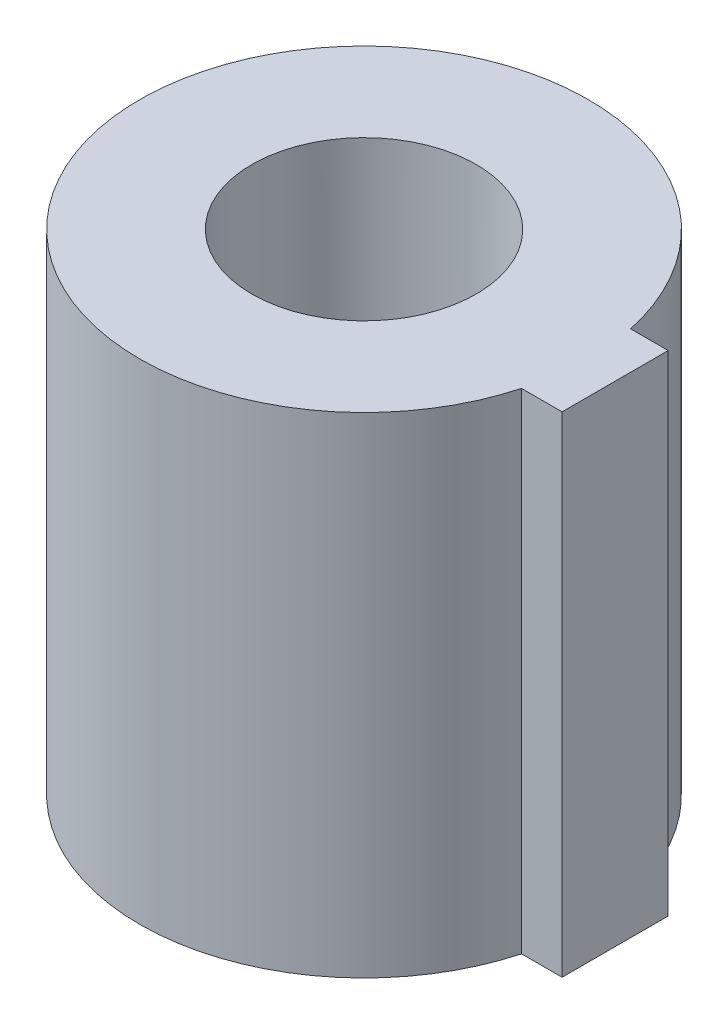
ISO-10303-21;
HEADER;
FILE_DESCRIPTION(('STEP AP214'),'2;1');
FILE_NAME('part.step','',(''),(''),'','','');
FILE_SCHEMA(('AUTOMOTIVE_DESIGN { 1 0 10303 214 1 1 1 1 }'));
ENDSEC;
DATA;
#1=APPLICATION_CONTEXT('core data for automotive mechanical design processes');
#2=APPLICATION_PROTOCOL_DEFINITION('international standard','automotive_design',2000,#1);
#3=PRODUCT_CONTEXT('',#1,'mechanical');
#4=PRODUCT('Part','Part','',(#3));
#5=PRODUCT_RELATED_PRODUCT_CATEGORY('part','',(#4));
#6=PRODUCT_DEFINITION_FORMATION('','',#4);
#7=PRODUCT_DEFINITION_CONTEXT('part definition',#1,'design');
#8=PRODUCT_DEFINITION('design','',#6,#7);
#9=PRODUCT_DEFINITION_SHAPE('','',#8);
#10=(LENGTH_UNIT() NAMED_UNIT(*) SI_UNIT(.MILLI.,.METRE.));
#11=(NAMED_UNIT(*) PLANE_ANGLE_UNIT() SI_UNIT($,.RADIAN.));
#12=(NAMED_UNIT(*) SI_UNIT($,.STERADIAN.) SOLID_ANGLE_UNIT());
#13=UNCERTAINTY_MEASURE_WITH_UNIT(LENGTH_MEASURE(1.E-05),#10,'distance_accuracy_value','');
#14=(GEOMETRIC_REPRESENTATION_CONTEXT(3) GLOBAL_UNCERTAINTY_ASSIGNED_CONTEXT((#13)) GLOBAL_UNIT_ASSIGNED_CONTEXT((#10,
#11,#12)) REPRESENTATION_CONTEXT('',''));
#15=CARTESIAN_POINT('',(0.,0.,0.));
#16=DIRECTION('',(0.,0.,1.));
#17=DIRECTION('',(1.,0.,0.));
#18=AXIS2_PLACEMENT_3D('',#15,#16,#17);
#19=CARTESIAN_POINT('',(0.,12.,0.));
#20=DIRECTION('',(0.,-1.,0.));
#21=DIRECTION('',(0.,0.,-1.));
#22=AXIS2_PLACEMENT_3D('',#19,#20,#21);
#23=CYLINDRICAL_SURFACE('',#22,5.5);
#24=CARTESIAN_POINT('',(0.,12.,0.));
#25=DIRECTION('',(0.,1.,0.));
#26=DIRECTION('',(0.,0.,1.));
#27=AXIS2_PLACEMENT_3D('',#24,#25,#26);
#28=CIRCLE('',#27,5.5);
#29=CARTESIAN_POINT('',(5.37784485907449,12.,-1.15272922741037));
#30=VERTEX_POINT('',#29);
#31=CARTESIAN_POINT('',(5.30616691320654,12.,1.44727077258963));
#32=VERTEX_POINT('',#31);
#33=EDGE_CURVE('E11',#30,#32,#28,.T.);
#34=ORIENTED_EDGE('',*,*,#33,.F.);
#35=DIRECTION('',(0.,-1.,0.));
#36=VECTOR('',#35,1.);
#37=CARTESIAN_POINT('',(5.37784485907449,12.,-1.15272922741037));
#38=LINE('',#37,#36);
#39=CARTESIAN_POINT('',(5.37784485907449,0.,-1.15272922741037));
#40=VERTEX_POINT('',#39);
#41=EDGE_CURVE('E188',#30,#40,#38,.T.);
#42=ORIENTED_EDGE('',*,*,#41,.T.);
#43=CARTESIAN_POINT('',(0.,0.,0.));
#44=DIRECTION('',(0.,1.,0.));
#45=DIRECTION('',(0.,0.,1.));
#46=AXIS2_PLACEMENT_3D('',#43,#44,#45);
#47=CIRCLE('',#46,5.5);
#48=CARTESIAN_POINT('',(5.30616691320654,0.,1.44727077258963));
#49=VERTEX_POINT('',#48);
#50=EDGE_CURVE('E41',#40,#49,#47,.T.);
#51=ORIENTED_EDGE('',*,*,#50,.T.);
#52=DIRECTION('',(0.,-1.,0.));
#53=VECTOR('',#52,1.);
#54=CARTESIAN_POINT('',(5.30616691320654,12.,1.44727077258963));
#55=LINE('',#54,#53);
#56=EDGE_CURVE('E183',#49,#32,#55,.F.);
#57=ORIENTED_EDGE('',*,*,#56,.T.);
#58=EDGE_LOOP('',(#34,#42,#51,#57));
#59=FACE_BOUND('',#58,.T.);
#60=ADVANCED_FACE('F33',(#59),#23,.T.);
#61=CARTESIAN_POINT('',(0.,12.,0.));
#62=DIRECTION('',(0.,1.,0.));
#63=DIRECTION('',(0.,0.,1.));
#64=AXIS2_PLACEMENT_3D('',#61,#62,#63);
#65=PLANE('',#64);
#66=CARTESIAN_POINT('',(0.,12.,0.));
#67=DIRECTION('',(0.,1.,0.));
#68=DIRECTION('',(0.,0.,1.));
#69=AXIS2_PLACEMENT_3D('',#66,#67,#68);
#70=CIRCLE('',#69,2.75);
#71=CARTESIAN_POINT('',(0.,12.,2.75));
#72=VERTEX_POINT('',#71);
#73=EDGE_CURVE('E139',#72,#72,#70,.T.);
#74=ORIENTED_EDGE('',*,*,#73,.F.);
#75=EDGE_LOOP('',(#74));
#76=FACE_BOUND('',#75,.T.);
#77=ORIENTED_EDGE('',*,*,#33,.T.);
#78=DIRECTION('',(1.,0.,0.));
#79=VECTOR('',#78,1.);
#80=CARTESIAN_POINT('',(6.3,12.,1.44727077258963));
#81=LINE('',#80,#79);
#82=CARTESIAN_POINT('',(6.3,12.,1.44727077258963));
#83=VERTEX_POINT('',#82);
#84=EDGE_CURVE('E161',#32,#83,#81,.T.);
#85=ORIENTED_EDGE('',*,*,#84,.T.);
#86=DIRECTION('',(0.,0.,-1.));
#87=VECTOR('',#86,1.);
#88=CARTESIAN_POINT('',(6.3,12.,-1.15272922741037));
#89=LINE('',#88,#87);
#90=CARTESIAN_POINT('',(6.3,12.,-1.15272922741037));
#91=VERTEX_POINT('',#90);
#92=EDGE_CURVE('E178',#83,#91,#89,.T.);
#93=ORIENTED_EDGE('',*,*,#92,.T.);
#94=DIRECTION('',(-1.,0.,0.));
#95=VECTOR('',#94,1.);
#96=CARTESIAN_POINT('',(6.3,12.,-1.15272922741037));
#97=LINE('',#96,#95);
#98=EDGE_CURVE('E56',#91,#30,#97,.T.);
#99=ORIENTED_EDGE('',*,*,#98,.T.);
#100=EDGE_LOOP('',(#77,#85,#93,#99));
#101=FACE_BOUND('',#100,.T.);
#102=ADVANCED_FACE('F205',(#76,#101),#65,.T.);
#103=CARTESIAN_POINT('',(0.,0.,0.));
#104=DIRECTION('',(0.,1.,0.));
#105=DIRECTION('',(0.,0.,1.));
#106=AXIS2_PLACEMENT_3D('',#103,#104,#105);
#107=PLANE('',#106);
#108=DIRECTION('',(0.575898821172485,0.,0.817520976961535));
#109=VECTOR('',#108,1.);
#110=CARTESIAN_POINT('',(1.89159998637329,0.,-4.08678963142863));
#111=LINE('',#110,#109);
#112=CARTESIAN_POINT('',(1.89159998637329,0.,-4.08678963142863));
#113=VERTEX_POINT('',#112);
#114=CARTESIAN_POINT('',(4.48506363392668,0.,-0.405221173716749));
#115=VERTEX_POINT('',#114);
#116=EDGE_CURVE('E149',#113,#115,#111,.T.);
#117=ORIENTED_EDGE('',*,*,#116,.F.);
#118=DIRECTION('',(0.995943344761604,0.,-0.0899825206641158));
#119=VECTOR('',#118,1.);
#120=CARTESIAN_POINT('',(-2.59346364755339,0.,-3.68156845771188));
#121=LINE('',#120,#119);
#122=CARTESIAN_POINT('',(-2.59346364755339,0.,-3.68156845771188));
#123=VERTEX_POINT('',#122);
#124=EDGE_CURVE('E49',#123,#113,#121,.T.);
#125=ORIENTED_EDGE('',*,*,#124,.F.);
#126=DIRECTION('',(0.42004452358912,0.,-0.907503497625651));
#127=VECTOR('',#126,1.);
#128=CARTESIAN_POINT('',(-4.48506363392668,0.,0.405221173716749));
#129=LINE('',#128,#127);
#130=CARTESIAN_POINT('',(-4.48506363392668,0.,0.405221173716749));
#131=VERTEX_POINT('',#130);
#132=EDGE_CURVE('E133',#131,#123,#129,.T.);
#133=ORIENTED_EDGE('',*,*,#132,.F.);
#134=DIRECTION('',(-0.575898821172485,0.,-0.817520976961535));
#135=VECTOR('',#134,1.);
#136=CARTESIAN_POINT('',(-1.89159998637329,0.,4.08678963142863));
#137=LINE('',#136,#135);
#138=CARTESIAN_POINT('',(-1.89159998637329,0.,4.08678963142863));
#139=VERTEX_POINT('',#138);
#140=EDGE_CURVE('E136',#139,#131,#137,.T.);
#141=ORIENTED_EDGE('',*,*,#140,.F.);
#142=DIRECTION('',(-0.995943344761604,0.,0.0899825206641161));
#143=VECTOR('',#142,1.);
#144=CARTESIAN_POINT('',(2.59346364755339,0.,3.68156845771188));
#145=LINE('',#144,#143);
#146=CARTESIAN_POINT('',(2.59346364755339,0.,3.68156845771188));
#147=VERTEX_POINT('',#146);
#148=EDGE_CURVE('E154',#147,#139,#145,.T.);
#149=ORIENTED_EDGE('',*,*,#148,.F.);
#150=DIRECTION('',(-0.42004452358912,0.,0.907503497625651));
#151=VECTOR('',#150,1.);
#152=CARTESIAN_POINT('',(4.48506363392668,0.,-0.405221173716749));
#153=LINE('',#152,#151);
#154=EDGE_CURVE('E151',#115,#147,#153,.T.);
#155=ORIENTED_EDGE('',*,*,#154,.F.);
#156=EDGE_LOOP('',(#117,#125,#133,#141,#149,#155));
#157=FACE_BOUND('',#156,.T.);
#158=ORIENTED_EDGE('',*,*,#50,.F.);
#159=DIRECTION('',(-1.,0.,0.));
#160=VECTOR('',#159,1.);
#161=CARTESIAN_POINT('',(6.3,0.,-1.15272922741037));
#162=LINE('',#161,#160);
#163=CARTESIAN_POINT('',(6.3,0.,-1.15272922741037));
#164=VERTEX_POINT('',#163);
#165=EDGE_CURVE('E174',#164,#40,#162,.T.);
#166=ORIENTED_EDGE('',*,*,#165,.F.);
#167=DIRECTION('',(0.,0.,-1.));
#168=VECTOR('',#167,1.);
#169=CARTESIAN_POINT('',(6.3,0.,-1.15272922741037));
#170=LINE('',#169,#168);
#171=CARTESIAN_POINT('',(6.3,0.,1.44727077258963));
#172=VERTEX_POINT('',#171);
#173=EDGE_CURVE('E171',#172,#164,#170,.T.);
#174=ORIENTED_EDGE('',*,*,#173,.F.);
#175=DIRECTION('',(1.,0.,0.));
#176=VECTOR('',#175,1.);
#177=CARTESIAN_POINT('',(6.3,0.,1.44727077258963));
#178=LINE('',#177,#176);
#179=EDGE_CURVE('E169',#49,#172,#178,.T.);
#180=ORIENTED_EDGE('',*,*,#179,.F.);
#181=EDGE_LOOP('',(#158,#166,#174,#180));
#182=FACE_BOUND('',#181,.T.);
#183=ADVANCED_FACE('F197',(#157,#182),#107,.F.);
#184=CARTESIAN_POINT('',(6.3,0.,-1.15272922741037));
#185=DIRECTION('',(0.,0.,-1.));
#186=DIRECTION('',(-1.,0.,0.));
#187=AXIS2_PLACEMENT_3D('',#184,#185,#186);
#188=PLANE('',#187);
#189=ORIENTED_EDGE('',*,*,#41,.F.);
#190=ORIENTED_EDGE('',*,*,#98,.F.);
#191=DIRECTION('',(0.,1.,0.));
#192=VECTOR('',#191,1.);
#193=CARTESIAN_POINT('',(6.3,0.,-1.15272922741037));
#194=LINE('',#193,#192);
#195=EDGE_CURVE('E181',#164,#91,#194,.T.);
#196=ORIENTED_EDGE('',*,*,#195,.F.);
#197=ORIENTED_EDGE('',*,*,#165,.T.);
#198=EDGE_LOOP('',(#189,#190,#196,#197));
#199=FACE_BOUND('',#198,.T.);
#200=ADVANCED_FACE('F207',(#199),#188,.T.);
#201=CARTESIAN_POINT('',(6.3,0.,1.44727077258963));
#202=DIRECTION('',(0.,0.,1.));
#203=DIRECTION('',(1.,0.,0.));
#204=AXIS2_PLACEMENT_3D('',#201,#202,#203);
#205=PLANE('',#204);
#206=ORIENTED_EDGE('',*,*,#56,.F.);
#207=ORIENTED_EDGE('',*,*,#179,.T.);
#208=DIRECTION('',(0.,1.,0.));
#209=VECTOR('',#208,1.);
#210=CARTESIAN_POINT('',(6.3,0.,1.44727077258963));
#211=LINE('',#210,#209);
#212=EDGE_CURVE('E176',#172,#83,#211,.T.);
#213=ORIENTED_EDGE('',*,*,#212,.T.);
#214=ORIENTED_EDGE('',*,*,#84,.F.);
#215=EDGE_LOOP('',(#206,#207,#213,#214));
#216=FACE_BOUND('',#215,.T.);
#217=ADVANCED_FACE('F201',(#216),#205,.T.);
#218=CARTESIAN_POINT('',(6.3,0.,-1.15272922741037));
#219=DIRECTION('',(1.,0.,0.));
#220=DIRECTION('',(0.,0.,-1.));
#221=AXIS2_PLACEMENT_3D('',#218,#219,#220);
#222=PLANE('',#221);
#223=ORIENTED_EDGE('',*,*,#92,.F.);
#224=ORIENTED_EDGE('',*,*,#212,.F.);
#225=ORIENTED_EDGE('',*,*,#173,.T.);
#226=ORIENTED_EDGE('',*,*,#195,.T.);
#227=EDGE_LOOP('',(#223,#224,#225,#226));
#228=FACE_BOUND('',#227,.T.);
#229=ADVANCED_FACE('F204',(#228),#222,.T.);
#230=CARTESIAN_POINT('',(-2.59346364755339,3.8,-3.68156845771188));
#231=DIRECTION('',(-0.0899825206641158,0.,-0.995943344761604));
#232=DIRECTION('',(-0.995943344761605,0.,0.0899825206641158));
#233=AXIS2_PLACEMENT_3D('',#230,#231,#232);
#234=PLANE('',#233);
#235=ORIENTED_EDGE('',*,*,#124,.T.);
#236=DIRECTION('',(0.,-1.,0.));
#237=VECTOR('',#236,1.);
#238=CARTESIAN_POINT('',(1.89159998637329,3.8,-4.08678963142863));
#239=LINE('',#238,#237);
#240=CARTESIAN_POINT('',(1.89159998637329,3.8,-4.08678963142863));
#241=VERTEX_POINT('',#240);
#242=EDGE_CURVE('E110',#241,#113,#239,.T.);
#243=ORIENTED_EDGE('',*,*,#242,.F.);
#244=DIRECTION('',(0.995943344761604,0.,-0.0899825206641158));
#245=VECTOR('',#244,1.);
#246=CARTESIAN_POINT('',(-2.59346364755339,3.8,-3.68156845771188));
#247=LINE('',#246,#245);
#248=CARTESIAN_POINT('',(-2.59346364755339,3.8,-3.68156845771188));
#249=VERTEX_POINT('',#248);
#250=EDGE_CURVE('E114',#249,#241,#247,.T.);
#251=ORIENTED_EDGE('',*,*,#250,.F.);
#252=DIRECTION('',(0.,-1.,0.));
#253=VECTOR('',#252,1.);
#254=CARTESIAN_POINT('',(-2.59346364755339,3.8,-3.68156845771188));
#255=LINE('',#254,#253);
#256=EDGE_CURVE('E159',#249,#123,#255,.T.);
#257=ORIENTED_EDGE('',*,*,#256,.T.);
#258=EDGE_LOOP('',(#235,#243,#251,#257));
#259=FACE_BOUND('',#258,.T.);
#260=ADVANCED_FACE('F112',(#259),#234,.F.);
#261=CARTESIAN_POINT('',(-4.48506363392668,3.8,0.405221173716749));
#262=DIRECTION('',(-0.907503497625651,0.,-0.42004452358912));
#263=DIRECTION('',(-0.42004452358912,0.,0.907503497625651));
#264=AXIS2_PLACEMENT_3D('',#261,#262,#263);
#265=PLANE('',#264);
#266=ORIENTED_EDGE('',*,*,#132,.T.);
#267=ORIENTED_EDGE('',*,*,#256,.F.);
#268=DIRECTION('',(0.42004452358912,0.,-0.907503497625651));
#269=VECTOR('',#268,1.);
#270=CARTESIAN_POINT('',(-4.48506363392668,3.8,0.405221173716749));
#271=LINE('',#270,#269);
#272=CARTESIAN_POINT('',(-4.48506363392668,3.8,0.405221173716749));
#273=VERTEX_POINT('',#272);
#274=EDGE_CURVE('E120',#273,#249,#271,.T.);
#275=ORIENTED_EDGE('',*,*,#274,.F.);
#276=DIRECTION('',(0.,-1.,0.));
#277=VECTOR('',#276,1.);
#278=CARTESIAN_POINT('',(-4.48506363392668,3.8,0.405221173716749));
#279=LINE('',#278,#277);
#280=EDGE_CURVE('E162',#273,#131,#279,.T.);
#281=ORIENTED_EDGE('',*,*,#280,.T.);
#282=EDGE_LOOP('',(#266,#267,#275,#281));
#283=FACE_BOUND('',#282,.T.);
#284=ADVANCED_FACE('F231',(#283),#265,.F.);
#285=CARTESIAN_POINT('',(-1.89159998637329,3.8,4.08678963142863));
#286=DIRECTION('',(-0.817520976961535,0.,0.575898821172485));
#287=DIRECTION('',(0.575898821172485,0.,0.817520976961535));
#288=AXIS2_PLACEMENT_3D('',#285,#286,#287);
#289=PLANE('',#288);
#290=ORIENTED_EDGE('',*,*,#140,.T.);
#291=ORIENTED_EDGE('',*,*,#280,.F.);
#292=DIRECTION('',(-0.575898821172485,0.,-0.817520976961535));
#293=VECTOR('',#292,1.);
#294=CARTESIAN_POINT('',(-1.89159998637329,3.8,4.08678963142863));
#295=LINE('',#294,#293);
#296=CARTESIAN_POINT('',(-1.89159998637329,3.8,4.08678963142863));
#297=VERTEX_POINT('',#296);
#298=EDGE_CURVE('E145',#297,#273,#295,.T.);
#299=ORIENTED_EDGE('',*,*,#298,.F.);
#300=DIRECTION('',(0.,-1.,0.));
#301=VECTOR('',#300,1.);
#302=CARTESIAN_POINT('',(-1.89159998637329,3.8,4.08678963142863));
#303=LINE('',#302,#301);
#304=EDGE_CURVE('E164',#297,#139,#303,.T.);
#305=ORIENTED_EDGE('',*,*,#304,.T.);
#306=EDGE_LOOP('',(#290,#291,#299,#305));
#307=FACE_BOUND('',#306,.T.);
#308=ADVANCED_FACE('F235',(#307),#289,.F.);
#309=CARTESIAN_POINT('',(2.59346364755339,3.8,3.68156845771188));
#310=DIRECTION('',(0.0899825206641161,0.,0.995943344761604));
#311=DIRECTION('',(0.995943344761605,0.,-0.0899825206641162));
#312=AXIS2_PLACEMENT_3D('',#309,#310,#311);
#313=PLANE('',#312);
#314=ORIENTED_EDGE('',*,*,#148,.T.);
#315=ORIENTED_EDGE('',*,*,#304,.F.);
#316=DIRECTION('',(-0.995943344761604,0.,0.0899825206641161));
#317=VECTOR('',#316,1.);
#318=CARTESIAN_POINT('',(2.59346364755339,3.8,3.68156845771188));
#319=LINE('',#318,#317);
#320=CARTESIAN_POINT('',(2.59346364755339,3.8,3.68156845771188));
#321=VERTEX_POINT('',#320);
#322=EDGE_CURVE('E142',#321,#297,#319,.T.);
#323=ORIENTED_EDGE('',*,*,#322,.F.);
#324=DIRECTION('',(0.,-1.,0.));
#325=VECTOR('',#324,1.);
#326=CARTESIAN_POINT('',(2.59346364755339,3.8,3.68156845771188));
#327=LINE('',#326,#325);
#328=EDGE_CURVE('E166',#321,#147,#327,.T.);
#329=ORIENTED_EDGE('',*,*,#328,.T.);
#330=EDGE_LOOP('',(#314,#315,#323,#329));
#331=FACE_BOUND('',#330,.T.);
#332=ADVANCED_FACE('F244',(#331),#313,.F.);
#333=CARTESIAN_POINT('',(4.48506363392668,3.8,-0.405221173716749));
#334=DIRECTION('',(0.907503497625651,0.,0.42004452358912));
#335=DIRECTION('',(0.42004452358912,0.,-0.907503497625651));
#336=AXIS2_PLACEMENT_3D('',#333,#334,#335);
#337=PLANE('',#336);
#338=ORIENTED_EDGE('',*,*,#154,.T.);
#339=ORIENTED_EDGE('',*,*,#328,.F.);
#340=DIRECTION('',(-0.42004452358912,0.,0.907503497625651));
#341=VECTOR('',#340,1.);
#342=CARTESIAN_POINT('',(4.48506363392668,3.8,-0.405221173716749));
#343=LINE('',#342,#341);
#344=CARTESIAN_POINT('',(4.48506363392668,3.8,-0.405221173716749));
#345=VERTEX_POINT('',#344);
#346=EDGE_CURVE('E128',#345,#321,#343,.T.);
#347=ORIENTED_EDGE('',*,*,#346,.F.);
#348=DIRECTION('',(0.,-1.,0.));
#349=VECTOR('',#348,1.);
#350=CARTESIAN_POINT('',(4.48506363392668,3.8,-0.405221173716749));
#351=LINE('',#350,#349);
#352=EDGE_CURVE('E119',#345,#115,#351,.T.);
#353=ORIENTED_EDGE('',*,*,#352,.T.);
#354=EDGE_LOOP('',(#338,#339,#347,#353));
#355=FACE_BOUND('',#354,.T.);
#356=ADVANCED_FACE('F241',(#355),#337,.F.);
#357=CARTESIAN_POINT('',(1.89159998637329,3.8,-4.08678963142863));
#358=DIRECTION('',(0.817520976961535,0.,-0.575898821172484));
#359=DIRECTION('',(-0.575898821172484,0.,-0.817520976961535));
#360=AXIS2_PLACEMENT_3D('',#357,#358,#359);
#361=PLANE('',#360);
#362=ORIENTED_EDGE('',*,*,#116,.T.);
#363=ORIENTED_EDGE('',*,*,#352,.F.);
#364=DIRECTION('',(0.575898821172485,0.,0.817520976961535));
#365=VECTOR('',#364,1.);
#366=CARTESIAN_POINT('',(1.89159998637329,3.8,-4.08678963142863));
#367=LINE('',#366,#365);
#368=EDGE_CURVE('E123',#241,#345,#367,.T.);
#369=ORIENTED_EDGE('',*,*,#368,.F.);
#370=ORIENTED_EDGE('',*,*,#242,.T.);
#371=EDGE_LOOP('',(#362,#363,#369,#370));
#372=FACE_BOUND('',#371,.T.);
#373=ADVANCED_FACE('F124',(#372),#361,.F.);
#374=CARTESIAN_POINT('',(0.,3.8,0.));
#375=DIRECTION('',(0.,-1.,0.));
#376=DIRECTION('',(0.,0.,-1.));
#377=AXIS2_PLACEMENT_3D('',#374,#375,#376);
#378=PLANE('',#377);
#379=CARTESIAN_POINT('',(0.,3.8,0.));
#380=DIRECTION('',(0.,-1.,0.));
#381=DIRECTION('',(0.,0.,-1.));
#382=AXIS2_PLACEMENT_3D('',#379,#380,#381);
#383=CIRCLE('',#382,2.75);
#384=CARTESIAN_POINT('',(0.,3.8,-2.75));
#385=VERTEX_POINT('',#384);
#386=EDGE_CURVE('E36',#385,#385,#383,.T.);
#387=ORIENTED_EDGE('',*,*,#386,.F.);
#388=EDGE_LOOP('',(#387));
#389=FACE_BOUND('',#388,.T.);
#390=ORIENTED_EDGE('',*,*,#250,.T.);
#391=ORIENTED_EDGE('',*,*,#368,.T.);
#392=ORIENTED_EDGE('',*,*,#346,.T.);
#393=ORIENTED_EDGE('',*,*,#322,.T.);
#394=ORIENTED_EDGE('',*,*,#298,.T.);
#395=ORIENTED_EDGE('',*,*,#274,.T.);
#396=EDGE_LOOP('',(#390,#391,#392,#393,#394,#395));
#397=FACE_BOUND('',#396,.T.);
#398=ADVANCED_FACE('F130',(#389,#397),#378,.T.);
#399=CARTESIAN_POINT('',(0.,-5.65,0.));
#400=DIRECTION('',(0.,1.,0.));
#401=DIRECTION('',(0.,0.,1.));
#402=AXIS2_PLACEMENT_3D('',#399,#400,#401);
#403=CYLINDRICAL_SURFACE('',#402,2.75);
#404=ORIENTED_EDGE('',*,*,#386,.T.);
#405=EDGE_LOOP('',(#404));
#406=FACE_BOUND('',#405,.T.);
#407=ORIENTED_EDGE('',*,*,#73,.T.);
#408=EDGE_LOOP('',(#407));
#409=FACE_BOUND('',#408,.T.);
#410=ADVANCED_FACE('F254',(#406,#409),#403,.F.);
#411=CLOSED_SHELL('',(#60,#102,#183,#200,#217,#229,#260,#284,#308,#332,#356,#373,#398,#410));
#412=MANIFOLD_SOLID_BREP('B2',#411);
#413=ADVANCED_BREP_SHAPE_REPRESENTATION('',(#18,#412),#14);
#414=SHAPE_DEFINITION_REPRESENTATION(#9,#413);
ENDSEC;
END-ISO-10303-21;
